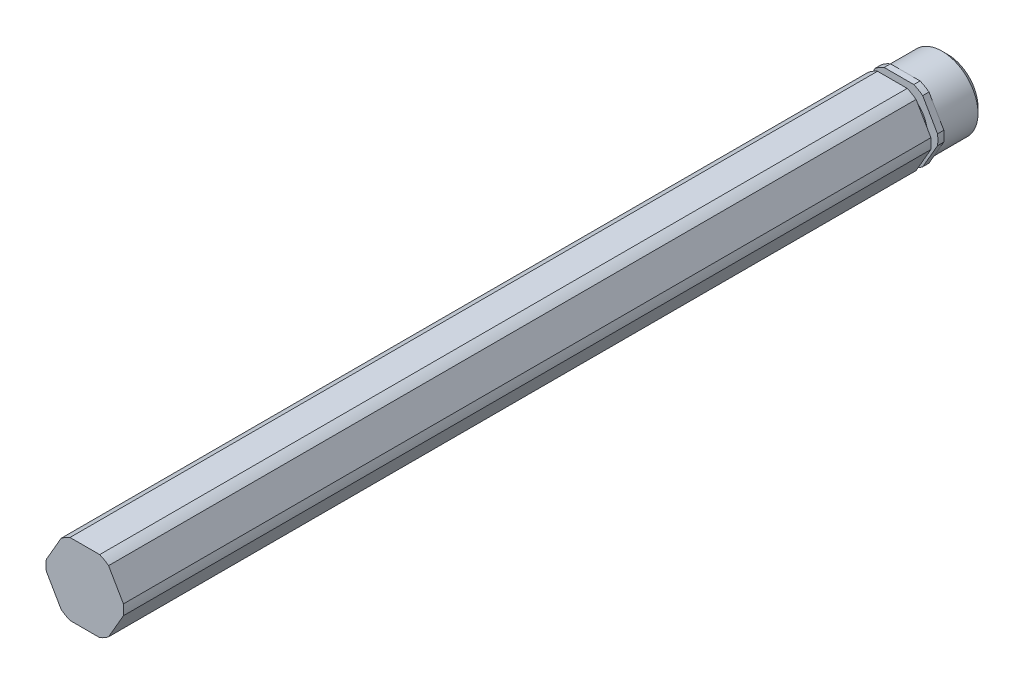
ISO-10303-21;
HEADER;
FILE_DESCRIPTION(('STEP AP214'),'2;1');
FILE_NAME('part.step','',(''),(''),'','','');
FILE_SCHEMA(('AUTOMOTIVE_DESIGN { 1 0 10303 214 1 1 1 1 }'));
ENDSEC;
DATA;
#1=APPLICATION_CONTEXT('core data for automotive mechanical design processes');
#2=APPLICATION_PROTOCOL_DEFINITION('international standard','automotive_design',2000,#1);
#3=PRODUCT_CONTEXT('',#1,'mechanical');
#4=PRODUCT('Part','Part','',(#3));
#5=PRODUCT_RELATED_PRODUCT_CATEGORY('part','',(#4));
#6=PRODUCT_DEFINITION_FORMATION('','',#4);
#7=PRODUCT_DEFINITION_CONTEXT('part definition',#1,'design');
#8=PRODUCT_DEFINITION('design','',#6,#7);
#9=PRODUCT_DEFINITION_SHAPE('','',#8);
#10=(LENGTH_UNIT() NAMED_UNIT(*) SI_UNIT(.MILLI.,.METRE.));
#11=(NAMED_UNIT(*) PLANE_ANGLE_UNIT() SI_UNIT($,.RADIAN.));
#12=(NAMED_UNIT(*) SI_UNIT($,.STERADIAN.) SOLID_ANGLE_UNIT());
#13=UNCERTAINTY_MEASURE_WITH_UNIT(LENGTH_MEASURE(1.E-05),#10,'distance_accuracy_value','');
#14=(GEOMETRIC_REPRESENTATION_CONTEXT(3) GLOBAL_UNCERTAINTY_ASSIGNED_CONTEXT((#13)) GLOBAL_UNIT_ASSIGNED_CONTEXT((#10,
#11,#12)) REPRESENTATION_CONTEXT('',''));
#15=CARTESIAN_POINT('',(0.,0.,0.));
#16=DIRECTION('',(0.,0.,1.));
#17=DIRECTION('',(1.,0.,0.));
#18=AXIS2_PLACEMENT_3D('',#15,#16,#17);
#19=CARTESIAN_POINT('',(7.33234841871,0.,-76.2));
#20=DIRECTION('',(0.,0.,1.));
#21=DIRECTION('',(1.,0.,0.));
#22=AXIS2_PLACEMENT_3D('',#19,#20,#21);
#23=PLANE('',#22);
#24=CARTESIAN_POINT('',(0.,0.,-76.2000000000285));
#25=DIRECTION('',(0.,0.,1.));
#26=DIRECTION('',(1.,0.,0.));
#27=AXIS2_PLACEMENT_3D('',#24,#25,#26);
#28=CIRCLE('',#27,5.35000000007813);
#29=CARTESIAN_POINT('',(5.35000000007813,0.,-76.2000000000285));
#30=VERTEX_POINT('',#29);
#31=EDGE_CURVE('E20',#30,#30,#28,.T.);
#32=ORIENTED_EDGE('',*,*,#31,.F.);
#33=EDGE_LOOP('',(#32));
#34=FACE_BOUND('',#33,.T.);
#35=ADVANCED_FACE('F17',(#34),#23,.F.);
#36=CARTESIAN_POINT('',(0.,0.,-75.200000000109));
#37=DIRECTION('',(0.,0.,1.));
#38=DIRECTION('',(1.,0.,0.));
#39=AXIS2_PLACEMENT_3D('',#36,#37,#38);
#40=CONICAL_SURFACE('',#39,6.34999999994079,0.785398163369027);
#41=ORIENTED_EDGE('',*,*,#31,.T.);
#42=EDGE_LOOP('',(#41));
#43=FACE_BOUND('',#42,.T.);
#44=CARTESIAN_POINT('',(0.,0.,-75.2));
#45=DIRECTION('',(0.,0.,-1.));
#46=DIRECTION('',(-1.,0.,0.));
#47=AXIS2_PLACEMENT_3D('',#44,#45,#46);
#48=CIRCLE('',#47,6.35);
#49=CARTESIAN_POINT('',(-6.35,0.,-75.2));
#50=VERTEX_POINT('',#49);
#51=EDGE_CURVE('E216',#50,#50,#48,.F.);
#52=ORIENTED_EDGE('',*,*,#51,.F.);
#53=EDGE_LOOP('',(#52));
#54=FACE_BOUND('',#53,.T.);
#55=ADVANCED_FACE('F614',(#43,#54),#40,.T.);
#56=CARTESIAN_POINT('',(0.,0.,-68.704));
#57=DIRECTION('',(0.,0.,-1.));
#58=DIRECTION('',(-1.,0.,0.));
#59=AXIS2_PLACEMENT_3D('',#56,#57,#58);
#60=CYLINDRICAL_SURFACE('',#59,6.35);
#61=CARTESIAN_POINT('',(0.,0.,-68.704));
#62=DIRECTION('',(0.,0.,-1.));
#63=DIRECTION('',(-1.,0.,0.));
#64=AXIS2_PLACEMENT_3D('',#61,#62,#63);
#65=CIRCLE('',#64,6.35);
#66=CARTESIAN_POINT('',(5.49926131387724,-3.17500000026387,-68.7039999996));
#67=VERTEX_POINT('',#66);
#68=CARTESIAN_POINT('',(5.499261314031,3.17500000000104,-68.704));
#69=VERTEX_POINT('',#68);
#70=EDGE_CURVE('E191',#67,#69,#65,.F.);
#71=ORIENTED_EDGE('',*,*,#70,.F.);
#72=CARTESIAN_POINT('',(0.,0.,-68.7039999992));
#73=DIRECTION('',(0.,0.,-1.));
#74=DIRECTION('',(-1.,0.,0.));
#75=AXIS2_PLACEMENT_3D('',#72,#73,#74);
#76=CIRCLE('',#75,6.35);
#77=CARTESIAN_POINT('',(-3.04382604190967E-10,-6.35,-68.7039999992));
#78=VERTEX_POINT('',#77);
#79=EDGE_CURVE('E202',#78,#67,#76,.F.);
#80=ORIENTED_EDGE('',*,*,#79,.F.);
#81=CARTESIAN_POINT('',(0.,0.,-68.7039999992));
#82=DIRECTION('',(0.,0.,-1.));
#83=DIRECTION('',(-1.,0.,0.));
#84=AXIS2_PLACEMENT_3D('',#81,#82,#83);
#85=CIRCLE('',#84,6.35);
#86=CARTESIAN_POINT('',(-5.4992613141845,-3.17499999973517,-68.7039999992));
#87=VERTEX_POINT('',#86);
#88=EDGE_CURVE('E321',#87,#78,#85,.F.);
#89=ORIENTED_EDGE('',*,*,#88,.F.);
#90=CARTESIAN_POINT('',(0.,0.,-68.7039999992));
#91=DIRECTION('',(0.,0.,-1.));
#92=DIRECTION('',(-1.,0.,0.));
#93=AXIS2_PLACEMENT_3D('',#90,#91,#92);
#94=CIRCLE('',#93,6.35);
#95=CARTESIAN_POINT('',(-5.49926131402949,3.17500000000017,-68.704));
#96=VERTEX_POINT('',#95);
#97=EDGE_CURVE('E323',#96,#87,#94,.F.);
#98=ORIENTED_EDGE('',*,*,#97,.F.);
#99=CARTESIAN_POINT('',(0.,0.,-68.704));
#100=DIRECTION('',(0.,0.,-1.));
#101=DIRECTION('',(-1.,0.,0.));
#102=AXIS2_PLACEMENT_3D('',#99,#100,#101);
#103=CIRCLE('',#102,6.35);
#104=CARTESIAN_POINT('',(0.,6.35,-68.704));
#105=VERTEX_POINT('',#104);
#106=EDGE_CURVE('E211',#105,#96,#103,.F.);
#107=ORIENTED_EDGE('',*,*,#106,.F.);
#108=CARTESIAN_POINT('',(0.,0.,-68.704));
#109=DIRECTION('',(0.,0.,-1.));
#110=DIRECTION('',(-1.,0.,0.));
#111=AXIS2_PLACEMENT_3D('',#108,#109,#110);
#112=CIRCLE('',#111,6.35);
#113=EDGE_CURVE('E207',#69,#105,#112,.F.);
#114=ORIENTED_EDGE('',*,*,#113,.F.);
#115=EDGE_LOOP('',(#71,#80,#89,#98,#107,#114));
#116=FACE_BOUND('',#115,.T.);
#117=ORIENTED_EDGE('',*,*,#51,.T.);
#118=EDGE_LOOP('',(#117));
#119=FACE_BOUND('',#118,.T.);
#120=ADVANCED_FACE('F208',(#116,#119),#60,.T.);
#121=CARTESIAN_POINT('',(0.,0.,-68.704));
#122=DIRECTION('',(0.,0.,-1.));
#123=DIRECTION('',(-1.,0.,0.));
#124=AXIS2_PLACEMENT_3D('',#121,#122,#123);
#125=PLANE('',#124);
#126=DIRECTION('',(0.50000000000019,-0.866025403784329,0.));
#127=VECTOR('',#126,1.);
#128=CARTESIAN_POINT('',(7.33234841871,0.,-68.7039999992));
#129=LINE('',#128,#127);
#130=CARTESIAN_POINT('',(4.18830746262131,5.44563867682668,-68.7039999992));
#131=VERTEX_POINT('',#130);
#132=EDGE_CURVE('E220',#131,#69,#129,.T.);
#133=ORIENTED_EDGE('',*,*,#132,.T.);
#134=ORIENTED_EDGE('',*,*,#113,.T.);
#135=DIRECTION('',(1.,0.,0.));
#136=VECTOR('',#135,1.);
#137=CARTESIAN_POINT('',(3.66617420935,6.35,-68.704));
#138=LINE('',#137,#136);
#139=CARTESIAN_POINT('',(2.62190770236911,6.35,-68.7039999996));
#140=VERTEX_POINT('',#139);
#141=EDGE_CURVE('E233',#105,#140,#138,.T.);
#142=ORIENTED_EDGE('',*,*,#141,.T.);
#143=CARTESIAN_POINT('',(0.,0.,-68.7039999992));
#144=DIRECTION('',(0.,0.,1.));
#145=DIRECTION('',(1.,0.,0.));
#146=AXIS2_PLACEMENT_3D('',#143,#144,#145);
#147=CIRCLE('',#146,6.87);
#148=EDGE_CURVE('E228',#131,#140,#147,.T.);
#149=ORIENTED_EDGE('',*,*,#148,.F.);
#150=EDGE_LOOP('',(#133,#134,#142,#149));
#151=FACE_BOUND('',#150,.T.);
#152=ADVANCED_FACE('F227',(#151),#125,.T.);
#153=CARTESIAN_POINT('',(0.,0.,-68.704));
#154=DIRECTION('',(0.,0.,-1.));
#155=DIRECTION('',(-1.,0.,0.));
#156=AXIS2_PLACEMENT_3D('',#153,#154,#155);
#157=PLANE('',#156);
#158=DIRECTION('',(1.,0.,0.));
#159=VECTOR('',#158,1.);
#160=CARTESIAN_POINT('',(3.66617420935,6.35,-68.7039999992));
#161=LINE('',#160,#159);
#162=CARTESIAN_POINT('',(-2.62190770265393,6.34999999990268,-68.7039999992));
#163=VERTEX_POINT('',#162);
#164=EDGE_CURVE('E318',#163,#105,#161,.T.);
#165=ORIENTED_EDGE('',*,*,#164,.T.);
#166=ORIENTED_EDGE('',*,*,#106,.T.);
#167=DIRECTION('',(0.50000000000019,0.866025403784329,0.));
#168=VECTOR('',#167,1.);
#169=CARTESIAN_POINT('',(-3.66617420935,6.35,-68.704));
#170=LINE('',#169,#168);
#171=CARTESIAN_POINT('',(-4.18830746284096,5.44563867663288,-68.7039999996));
#172=VERTEX_POINT('',#171);
#173=EDGE_CURVE('E331',#96,#172,#170,.T.);
#174=ORIENTED_EDGE('',*,*,#173,.T.);
#175=CARTESIAN_POINT('',(0.,0.,-68.7039999992));
#176=DIRECTION('',(0.,0.,1.));
#177=DIRECTION('',(1.,0.,0.));
#178=AXIS2_PLACEMENT_3D('',#175,#176,#177);
#179=CIRCLE('',#178,6.87);
#180=EDGE_CURVE('E314',#163,#172,#179,.T.);
#181=ORIENTED_EDGE('',*,*,#180,.F.);
#182=EDGE_LOOP('',(#165,#166,#174,#181));
#183=FACE_BOUND('',#182,.T.);
#184=ADVANCED_FACE('F329',(#183),#157,.T.);
#185=CARTESIAN_POINT('',(0.,0.,-68.704));
#186=DIRECTION('',(0.,0.,-1.));
#187=DIRECTION('',(-1.,0.,0.));
#188=AXIS2_PLACEMENT_3D('',#185,#186,#187);
#189=PLANE('',#188);
#190=DIRECTION('',(0.50000000000019,0.866025403784329,0.));
#191=VECTOR('',#190,1.);
#192=CARTESIAN_POINT('',(-3.66617420935,6.35,-68.7039999992));
#193=LINE('',#192,#191);
#194=CARTESIAN_POINT('',(-6.81021516527427,0.904361323071907,-68.7039999992));
#195=VERTEX_POINT('',#194);
#196=EDGE_CURVE('E316',#195,#96,#193,.T.);
#197=ORIENTED_EDGE('',*,*,#196,.T.);
#198=ORIENTED_EDGE('',*,*,#97,.T.);
#199=DIRECTION('',(-0.50000000000019,0.866025403784329,0.));
#200=VECTOR('',#199,1.);
#201=CARTESIAN_POINT('',(-7.33234841871,0.,-68.7039999992));
#202=LINE('',#201,#200);
#203=CARTESIAN_POINT('',(-6.81021516521675,-0.904361323371107,-68.7039999996));
#204=VERTEX_POINT('',#203);
#205=EDGE_CURVE('E349',#87,#204,#202,.T.);
#206=ORIENTED_EDGE('',*,*,#205,.T.);
#207=CARTESIAN_POINT('',(0.,0.,-68.704));
#208=DIRECTION('',(0.,0.,1.));
#209=DIRECTION('',(1.,0.,0.));
#210=AXIS2_PLACEMENT_3D('',#207,#208,#209);
#211=CIRCLE('',#210,6.87);
#212=EDGE_CURVE('E310',#195,#204,#211,.T.);
#213=ORIENTED_EDGE('',*,*,#212,.F.);
#214=EDGE_LOOP('',(#197,#198,#206,#213));
#215=FACE_BOUND('',#214,.T.);
#216=ADVANCED_FACE('F344',(#215),#189,.T.);
#217=CARTESIAN_POINT('',(0.,0.,-68.704));
#218=DIRECTION('',(0.,0.,-1.));
#219=DIRECTION('',(-1.,0.,0.));
#220=AXIS2_PLACEMENT_3D('',#217,#218,#219);
#221=PLANE('',#220);
#222=DIRECTION('',(-0.50000000000019,0.866025403784329,0.));
#223=VECTOR('',#222,1.);
#224=CARTESIAN_POINT('',(-7.33234841871,0.,-68.7039999992));
#225=LINE('',#224,#223);
#226=CARTESIAN_POINT('',(-4.18830746262132,-5.44563867682667,-68.7039999992));
#227=VERTEX_POINT('',#226);
#228=EDGE_CURVE('E312',#227,#87,#225,.T.);
#229=ORIENTED_EDGE('',*,*,#228,.T.);
#230=ORIENTED_EDGE('',*,*,#88,.T.);
#231=DIRECTION('',(1.,0.,0.));
#232=VECTOR('',#231,1.);
#233=CARTESIAN_POINT('',(-3.66617420935,-6.35,-68.7039999992));
#234=LINE('',#233,#232);
#235=CARTESIAN_POINT('',(-2.62190770236911,-6.35,-68.7039999992));
#236=VERTEX_POINT('',#235);
#237=EDGE_CURVE('E370',#78,#236,#234,.F.);
#238=ORIENTED_EDGE('',*,*,#237,.T.);
#239=CARTESIAN_POINT('',(0.,0.,-68.7039999992));
#240=DIRECTION('',(0.,0.,1.));
#241=DIRECTION('',(1.,0.,0.));
#242=AXIS2_PLACEMENT_3D('',#239,#240,#241);
#243=CIRCLE('',#242,6.87);
#244=EDGE_CURVE('E306',#227,#236,#243,.T.);
#245=ORIENTED_EDGE('',*,*,#244,.F.);
#246=EDGE_LOOP('',(#229,#230,#238,#245));
#247=FACE_BOUND('',#246,.T.);
#248=ADVANCED_FACE('F604',(#247),#221,.T.);
#249=CARTESIAN_POINT('',(0.,0.,-68.704));
#250=DIRECTION('',(0.,0.,-1.));
#251=DIRECTION('',(-1.,0.,0.));
#252=AXIS2_PLACEMENT_3D('',#249,#250,#251);
#253=PLANE('',#252);
#254=DIRECTION('',(-0.50000000000019,-0.866025403784329,0.));
#255=VECTOR('',#254,1.);
#256=CARTESIAN_POINT('',(3.66617420935,-6.35,-68.7040000007));
#257=LINE('',#256,#255);
#258=CARTESIAN_POINT('',(6.81021516524065,-0.904361323325035,-68.7040000007));
#259=VERTEX_POINT('',#258);
#260=EDGE_CURVE('E198',#259,#67,#257,.T.);
#261=ORIENTED_EDGE('',*,*,#260,.T.);
#262=ORIENTED_EDGE('',*,*,#70,.T.);
#263=DIRECTION('',(0.50000000000019,-0.866025403784329,0.));
#264=VECTOR('',#263,1.);
#265=CARTESIAN_POINT('',(7.33234841871,0.,-68.704));
#266=LINE('',#265,#264);
#267=CARTESIAN_POINT('',(6.81021516522741,0.904361323368613,-68.70400000035));
#268=VERTEX_POINT('',#267);
#269=EDGE_CURVE('E195',#69,#268,#266,.T.);
#270=ORIENTED_EDGE('',*,*,#269,.T.);
#271=CARTESIAN_POINT('',(0.,0.,-68.7040000007));
#272=DIRECTION('',(0.,0.,1.));
#273=DIRECTION('',(1.,0.,0.));
#274=AXIS2_PLACEMENT_3D('',#271,#272,#273);
#275=CIRCLE('',#274,6.87);
#276=EDGE_CURVE('E203',#268,#259,#275,.F.);
#277=ORIENTED_EDGE('',*,*,#276,.T.);
#278=EDGE_LOOP('',(#261,#262,#270,#277));
#279=FACE_BOUND('',#278,.T.);
#280=ADVANCED_FACE('F193',(#279),#253,.T.);
#281=CARTESIAN_POINT('',(0.,0.,-68.704));
#282=DIRECTION('',(0.,0.,-1.));
#283=DIRECTION('',(-1.,0.,0.));
#284=AXIS2_PLACEMENT_3D('',#281,#282,#283);
#285=PLANE('',#284);
#286=DIRECTION('',(1.,0.,0.));
#287=VECTOR('',#286,1.);
#288=CARTESIAN_POINT('',(-3.66617420935,-6.35,-68.7039999992));
#289=LINE('',#288,#287);
#290=CARTESIAN_POINT('',(2.62190770265393,-6.34999999990268,-68.7039999992));
#291=VERTEX_POINT('',#290);
#292=EDGE_CURVE('E308',#291,#78,#289,.F.);
#293=ORIENTED_EDGE('',*,*,#292,.T.);
#294=ORIENTED_EDGE('',*,*,#79,.T.);
#295=DIRECTION('',(-0.50000000000019,-0.866025403784329,0.));
#296=VECTOR('',#295,1.);
#297=CARTESIAN_POINT('',(3.66617420935,-6.35,-68.7039999992));
#298=LINE('',#297,#296);
#299=CARTESIAN_POINT('',(4.18830746284096,-5.44563867663288,-68.7039999992));
#300=VERTEX_POINT('',#299);
#301=EDGE_CURVE('E364',#67,#300,#298,.T.);
#302=ORIENTED_EDGE('',*,*,#301,.T.);
#303=CARTESIAN_POINT('',(0.,0.,-68.7039999992));
#304=DIRECTION('',(0.,0.,1.));
#305=DIRECTION('',(1.,0.,0.));
#306=AXIS2_PLACEMENT_3D('',#303,#304,#305);
#307=CIRCLE('',#306,6.87);
#308=EDGE_CURVE('E303',#291,#300,#307,.T.);
#309=ORIENTED_EDGE('',*,*,#308,.F.);
#310=EDGE_LOOP('',(#293,#294,#302,#309));
#311=FACE_BOUND('',#310,.T.);
#312=ADVANCED_FACE('F598',(#311),#285,.T.);
#313=CARTESIAN_POINT('',(7.33234841871,0.,76.2));
#314=DIRECTION('',(-0.866025403784329,-0.50000000000019,0.));
#315=DIRECTION('',(0.50000000000019,-0.866025403784329,0.));
#316=AXIS2_PLACEMENT_3D('',#313,#314,#315);
#317=PLANE('',#316);
#318=ORIENTED_EDGE('',*,*,#269,.F.);
#319=ORIENTED_EDGE('',*,*,#132,.F.);
#320=DIRECTION('',(0.,0.,1.));
#321=VECTOR('',#320,1.);
#322=CARTESIAN_POINT('',(4.18830746242026,5.44563867698131,-76.2));
#323=LINE('',#322,#321);
#324=CARTESIAN_POINT('',(4.18830746266712,5.44563867684879,-67.5924000003));
#325=VERTEX_POINT('',#324);
#326=EDGE_CURVE('E224',#325,#131,#323,.F.);
#327=ORIENTED_EDGE('',*,*,#326,.F.);
#328=DIRECTION('',(-0.499999999998982,0.866025403785026,0.));
#329=VECTOR('',#328,1.);
#330=CARTESIAN_POINT('',(6.81021516519,0.904361323409,-67.5924));
#331=LINE('',#330,#329);
#332=CARTESIAN_POINT('',(6.81021516522723,0.904361323362622,-67.5924000003));
#333=VERTEX_POINT('',#332);
#334=EDGE_CURVE('E298',#333,#325,#331,.T.);
#335=ORIENTED_EDGE('',*,*,#334,.F.);
#336=DIRECTION('',(0.,0.,1.));
#337=VECTOR('',#336,1.);
#338=CARTESIAN_POINT('',(6.81021516522882,0.904361323414155,-76.2));
#339=LINE('',#338,#337);
#340=EDGE_CURVE('E223',#268,#333,#339,.T.);
#341=ORIENTED_EDGE('',*,*,#340,.F.);
#342=EDGE_LOOP('',(#318,#319,#327,#335,#341));
#343=FACE_BOUND('',#342,.T.);
#344=ADVANCED_FACE('F218',(#343),#317,.F.);
#345=CARTESIAN_POINT('',(0.,0.,-76.2));
#346=DIRECTION('',(0.,0.,1.));
#347=DIRECTION('',(1.,0.,0.));
#348=AXIS2_PLACEMENT_3D('',#345,#346,#347);
#349=CYLINDRICAL_SURFACE('',#348,6.87);
#350=ORIENTED_EDGE('',*,*,#326,.T.);
#351=ORIENTED_EDGE('',*,*,#148,.T.);
#352=DIRECTION('',(0.,0.,-1.));
#353=VECTOR('',#352,1.);
#354=CARTESIAN_POINT('',(2.62190770232,6.35,76.2));
#355=LINE('',#354,#353);
#356=CARTESIAN_POINT('',(2.62190770236911,6.35,-67.5924000003));
#357=VERTEX_POINT('',#356);
#358=EDGE_CURVE('E351',#140,#357,#355,.F.);
#359=ORIENTED_EDGE('',*,*,#358,.T.);
#360=CARTESIAN_POINT('',(0.,0.,-67.5924000006));
#361=DIRECTION('',(0.,0.,1.));
#362=DIRECTION('',(1.,0.,0.));
#363=AXIS2_PLACEMENT_3D('',#360,#361,#362);
#364=CIRCLE('',#363,6.87);
#365=EDGE_CURVE('E296',#325,#357,#364,.T.);
#366=ORIENTED_EDGE('',*,*,#365,.F.);
#367=EDGE_LOOP('',(#350,#351,#359,#366));
#368=FACE_BOUND('',#367,.T.);
#369=ADVANCED_FACE('F592',(#368),#349,.T.);
#370=CARTESIAN_POINT('',(3.66617420935,6.35,76.2));
#371=DIRECTION('',(0.,-1.,0.));
#372=DIRECTION('',(0.,0.,-1.));
#373=AXIS2_PLACEMENT_3D('',#370,#371,#372);
#374=PLANE('',#373);
#375=ORIENTED_EDGE('',*,*,#141,.F.);
#376=ORIENTED_EDGE('',*,*,#164,.F.);
#377=DIRECTION('',(0.,0.,1.));
#378=VECTOR('',#377,1.);
#379=CARTESIAN_POINT('',(-2.62190770288963,6.34999999980536,-76.2));
#380=LINE('',#379,#378);
#381=CARTESIAN_POINT('',(-2.62190770265393,6.34999999995134,-67.5924000003));
#382=VERTEX_POINT('',#381);
#383=EDGE_CURVE('E317',#382,#163,#380,.F.);
#384=ORIENTED_EDGE('',*,*,#383,.F.);
#385=DIRECTION('',(1.,0.,0.));
#386=VECTOR('',#385,1.);
#387=CARTESIAN_POINT('',(0.,6.35,-67.5924));
#388=LINE('',#387,#386);
#389=EDGE_CURVE('E295',#357,#382,#388,.F.);
#390=ORIENTED_EDGE('',*,*,#389,.F.);
#391=ORIENTED_EDGE('',*,*,#358,.F.);
#392=EDGE_LOOP('',(#375,#376,#384,#390,#391));
#393=FACE_BOUND('',#392,.T.);
#394=ADVANCED_FACE('F589',(#393),#374,.F.);
#395=CARTESIAN_POINT('',(0.,0.,-76.2));
#396=DIRECTION('',(0.,0.,1.));
#397=DIRECTION('',(1.,0.,0.));
#398=AXIS2_PLACEMENT_3D('',#395,#396,#397);
#399=CYLINDRICAL_SURFACE('',#398,6.87);
#400=ORIENTED_EDGE('',*,*,#383,.T.);
#401=ORIENTED_EDGE('',*,*,#180,.T.);
#402=DIRECTION('',(0.,0.,1.));
#403=VECTOR('',#402,1.);
#404=CARTESIAN_POINT('',(-4.18830746286678,5.44563867658814,76.2));
#405=LINE('',#404,#403);
#406=CARTESIAN_POINT('',(-4.18830746284562,5.44563867663038,-67.5924000003));
#407=VERTEX_POINT('',#406);
#408=EDGE_CURVE('E341',#172,#407,#405,.T.);
#409=ORIENTED_EDGE('',*,*,#408,.T.);
#410=CARTESIAN_POINT('',(0.,0.,-67.5924000006));
#411=DIRECTION('',(0.,0.,1.));
#412=DIRECTION('',(1.,0.,0.));
#413=AXIS2_PLACEMENT_3D('',#410,#411,#412);
#414=CIRCLE('',#413,6.87);
#415=EDGE_CURVE('E293',#382,#407,#414,.T.);
#416=ORIENTED_EDGE('',*,*,#415,.F.);
#417=EDGE_LOOP('',(#400,#401,#409,#416));
#418=FACE_BOUND('',#417,.T.);
#419=ADVANCED_FACE('F389',(#418),#399,.T.);
#420=CARTESIAN_POINT('',(-3.66617420935,6.35,76.2));
#421=DIRECTION('',(0.866025403784329,-0.50000000000019,0.));
#422=DIRECTION('',(0.50000000000019,0.866025403784329,0.));
#423=AXIS2_PLACEMENT_3D('',#420,#421,#422);
#424=PLANE('',#423);
#425=ORIENTED_EDGE('',*,*,#173,.F.);
#426=ORIENTED_EDGE('',*,*,#196,.F.);
#427=DIRECTION('',(0.,0.,1.));
#428=VECTOR('',#427,1.);
#429=CARTESIAN_POINT('',(-6.81021516530748,0.904361322821778,-76.2));
#430=LINE('',#429,#428);
#431=CARTESIAN_POINT('',(-6.81021516527331,0.904361323079125,-67.5924));
#432=VERTEX_POINT('',#431);
#433=EDGE_CURVE('E313',#432,#195,#430,.F.);
#434=ORIENTED_EDGE('',*,*,#433,.F.);
#435=DIRECTION('',(-0.500000000000495,-0.866025403784153,0.));
#436=VECTOR('',#435,1.);
#437=CARTESIAN_POINT('',(-4.18830746287,5.44563867659,-67.5924));
#438=LINE('',#437,#436);
#439=EDGE_CURVE('E292',#407,#432,#438,.T.);
#440=ORIENTED_EDGE('',*,*,#439,.F.);
#441=ORIENTED_EDGE('',*,*,#408,.F.);
#442=EDGE_LOOP('',(#425,#426,#434,#440,#441));
#443=FACE_BOUND('',#442,.T.);
#444=ADVANCED_FACE('F336',(#443),#424,.F.);
#445=CARTESIAN_POINT('',(0.,0.,-76.2));
#446=DIRECTION('',(0.,0.,1.));
#447=DIRECTION('',(1.,0.,0.));
#448=AXIS2_PLACEMENT_3D('',#445,#446,#447);
#449=CYLINDRICAL_SURFACE('',#448,6.87);
#450=DIRECTION('',(0.,0.,1.));
#451=VECTOR('',#450,1.);
#452=CARTESIAN_POINT('',(-6.81021516519366,-0.904361323411111,76.2));
#453=LINE('',#452,#451);
#454=CARTESIAN_POINT('',(-6.81021516521657,-0.904361323365096,-67.5924000003));
#455=VERTEX_POINT('',#454);
#456=EDGE_CURVE('E376',#204,#455,#453,.T.);
#457=ORIENTED_EDGE('',*,*,#456,.T.);
#458=CARTESIAN_POINT('',(0.,0.,-67.5924000006));
#459=DIRECTION('',(0.,0.,1.));
#460=DIRECTION('',(1.,0.,0.));
#461=AXIS2_PLACEMENT_3D('',#458,#459,#460);
#462=CIRCLE('',#461,6.87);
#463=EDGE_CURVE('E290',#432,#455,#462,.T.);
#464=ORIENTED_EDGE('',*,*,#463,.F.);
#465=ORIENTED_EDGE('',*,*,#433,.T.);
#466=ORIENTED_EDGE('',*,*,#212,.T.);
#467=EDGE_LOOP('',(#457,#464,#465,#466));
#468=FACE_BOUND('',#467,.T.);
#469=ADVANCED_FACE('F581',(#468),#449,.T.);
#470=CARTESIAN_POINT('',(-7.33234841871,0.,76.2));
#471=DIRECTION('',(0.866025403784329,0.50000000000019,0.));
#472=DIRECTION('',(-0.50000000000019,0.866025403784329,0.));
#473=AXIS2_PLACEMENT_3D('',#470,#471,#472);
#474=PLANE('',#473);
#475=ORIENTED_EDGE('',*,*,#205,.F.);
#476=ORIENTED_EDGE('',*,*,#228,.F.);
#477=DIRECTION('',(0.,0.,1.));
#478=VECTOR('',#477,1.);
#479=CARTESIAN_POINT('',(-4.18830746242026,-5.44563867698131,-76.2));
#480=LINE('',#479,#478);
#481=CARTESIAN_POINT('',(-4.18830746266712,-5.44563867684879,-67.5924000003));
#482=VERTEX_POINT('',#481);
#483=EDGE_CURVE('E309',#482,#227,#480,.F.);
#484=ORIENTED_EDGE('',*,*,#483,.F.);
#485=DIRECTION('',(0.499999999998982,-0.866025403785026,0.));
#486=VECTOR('',#485,1.);
#487=CARTESIAN_POINT('',(-6.81021516519,-0.904361323409,-67.5924));
#488=LINE('',#487,#486);
#489=EDGE_CURVE('E289',#455,#482,#488,.T.);
#490=ORIENTED_EDGE('',*,*,#489,.F.);
#491=ORIENTED_EDGE('',*,*,#456,.F.);
#492=EDGE_LOOP('',(#475,#476,#484,#490,#491));
#493=FACE_BOUND('',#492,.T.);
#494=ADVANCED_FACE('F578',(#493),#474,.F.);
#495=CARTESIAN_POINT('',(0.,0.,-76.2));
#496=DIRECTION('',(0.,0.,1.));
#497=DIRECTION('',(1.,0.,0.));
#498=AXIS2_PLACEMENT_3D('',#495,#496,#497);
#499=CYLINDRICAL_SURFACE('',#498,6.87);
#500=ORIENTED_EDGE('',*,*,#483,.T.);
#501=ORIENTED_EDGE('',*,*,#244,.T.);
#502=DIRECTION('',(0.,0.,1.));
#503=VECTOR('',#502,1.);
#504=CARTESIAN_POINT('',(-2.62190770232,-6.35,76.2));
#505=LINE('',#504,#503);
#506=CARTESIAN_POINT('',(-2.62190770236911,-6.35,-67.5924000003));
#507=VERTEX_POINT('',#506);
#508=EDGE_CURVE('E372',#236,#507,#505,.T.);
#509=ORIENTED_EDGE('',*,*,#508,.T.);
#510=CARTESIAN_POINT('',(0.,0.,-67.5924000006));
#511=DIRECTION('',(0.,0.,1.));
#512=DIRECTION('',(1.,0.,0.));
#513=AXIS2_PLACEMENT_3D('',#510,#511,#512);
#514=CIRCLE('',#513,6.87);
#515=EDGE_CURVE('E287',#482,#507,#514,.T.);
#516=ORIENTED_EDGE('',*,*,#515,.F.);
#517=EDGE_LOOP('',(#500,#501,#509,#516));
#518=FACE_BOUND('',#517,.T.);
#519=ADVANCED_FACE('F410',(#518),#499,.T.);
#520=CARTESIAN_POINT('',(-3.66617420935,-6.35,76.2));
#521=DIRECTION('',(0.,1.,0.));
#522=DIRECTION('',(0.,0.,1.));
#523=AXIS2_PLACEMENT_3D('',#520,#521,#522);
#524=PLANE('',#523);
#525=ORIENTED_EDGE('',*,*,#237,.F.);
#526=ORIENTED_EDGE('',*,*,#292,.F.);
#527=DIRECTION('',(0.,0.,1.));
#528=VECTOR('',#527,1.);
#529=CARTESIAN_POINT('',(2.62190770288963,-6.34999999980536,-76.2));
#530=LINE('',#529,#528);
#531=CARTESIAN_POINT('',(2.62190770265393,-6.34999999995134,-67.5924000003));
#532=VERTEX_POINT('',#531);
#533=EDGE_CURVE('E305',#532,#291,#530,.F.);
#534=ORIENTED_EDGE('',*,*,#533,.F.);
#535=DIRECTION('',(1.,0.,0.));
#536=VECTOR('',#535,1.);
#537=CARTESIAN_POINT('',(0.,-6.35,-67.5924));
#538=LINE('',#537,#536);
#539=EDGE_CURVE('E286',#507,#532,#538,.T.);
#540=ORIENTED_EDGE('',*,*,#539,.F.);
#541=ORIENTED_EDGE('',*,*,#508,.F.);
#542=EDGE_LOOP('',(#525,#526,#534,#540,#541));
#543=FACE_BOUND('',#542,.T.);
#544=ADVANCED_FACE('F414',(#543),#524,.F.);
#545=CARTESIAN_POINT('',(0.,0.,-76.2));
#546=DIRECTION('',(0.,0.,1.));
#547=DIRECTION('',(1.,0.,0.));
#548=AXIS2_PLACEMENT_3D('',#545,#546,#547);
#549=CYLINDRICAL_SURFACE('',#548,6.87);
#550=ORIENTED_EDGE('',*,*,#533,.T.);
#551=ORIENTED_EDGE('',*,*,#308,.T.);
#552=DIRECTION('',(0.,0.,1.));
#553=VECTOR('',#552,1.);
#554=CARTESIAN_POINT('',(4.18830746286678,-5.44563867658814,76.2));
#555=LINE('',#554,#553);
#556=CARTESIAN_POINT('',(4.18830746284562,-5.44563867663038,-67.5924000003));
#557=VERTEX_POINT('',#556);
#558=EDGE_CURVE('E367',#300,#557,#555,.T.);
#559=ORIENTED_EDGE('',*,*,#558,.T.);
#560=CARTESIAN_POINT('',(0.,0.,-67.5924000006));
#561=DIRECTION('',(0.,0.,1.));
#562=DIRECTION('',(1.,0.,0.));
#563=AXIS2_PLACEMENT_3D('',#560,#561,#562);
#564=CIRCLE('',#563,6.87);
#565=EDGE_CURVE('E284',#532,#557,#564,.T.);
#566=ORIENTED_EDGE('',*,*,#565,.F.);
#567=EDGE_LOOP('',(#550,#551,#559,#566));
#568=FACE_BOUND('',#567,.T.);
#569=ADVANCED_FACE('F568',(#568),#549,.T.);
#570=CARTESIAN_POINT('',(3.66617420935,-6.35,76.2));
#571=DIRECTION('',(-0.866025403784329,0.50000000000019,0.));
#572=DIRECTION('',(-0.50000000000019,-0.866025403784329,0.));
#573=AXIS2_PLACEMENT_3D('',#570,#571,#572);
#574=PLANE('',#573);
#575=ORIENTED_EDGE('',*,*,#301,.F.);
#576=ORIENTED_EDGE('',*,*,#260,.F.);
#577=DIRECTION('',(0.,0.,1.));
#578=VECTOR('',#577,1.);
#579=CARTESIAN_POINT('',(6.81021516524026,-0.904361323328035,-76.2));
#580=LINE('',#579,#578);
#581=CARTESIAN_POINT('',(6.81021516524025,-0.904361323327696,-67.5924000001));
#582=VERTEX_POINT('',#581);
#583=EDGE_CURVE('E399',#582,#259,#580,.F.);
#584=ORIENTED_EDGE('',*,*,#583,.F.);
#585=DIRECTION('',(0.499999999999919,0.866025403784485,0.));
#586=VECTOR('',#585,1.);
#587=CARTESIAN_POINT('',(4.18830746287,-5.44563867659,-67.5924));
#588=LINE('',#587,#586);
#589=EDGE_CURVE('E283',#557,#582,#588,.T.);
#590=ORIENTED_EDGE('',*,*,#589,.F.);
#591=ORIENTED_EDGE('',*,*,#558,.F.);
#592=EDGE_LOOP('',(#575,#576,#584,#590,#591));
#593=FACE_BOUND('',#592,.T.);
#594=ADVANCED_FACE('F558',(#593),#574,.F.);
#595=CARTESIAN_POINT('',(0.,0.,-76.2));
#596=DIRECTION('',(0.,0.,1.));
#597=DIRECTION('',(1.,0.,0.));
#598=AXIS2_PLACEMENT_3D('',#595,#596,#597);
#599=CYLINDRICAL_SURFACE('',#598,6.87);
#600=ORIENTED_EDGE('',*,*,#340,.T.);
#601=CARTESIAN_POINT('',(0.,0.,-67.5924000006));
#602=DIRECTION('',(0.,0.,1.));
#603=DIRECTION('',(1.,0.,0.));
#604=AXIS2_PLACEMENT_3D('',#601,#602,#603);
#605=CIRCLE('',#604,6.87);
#606=EDGE_CURVE('E279',#582,#333,#605,.T.);
#607=ORIENTED_EDGE('',*,*,#606,.F.);
#608=ORIENTED_EDGE('',*,*,#583,.T.);
#609=ORIENTED_EDGE('',*,*,#276,.F.);
#610=EDGE_LOOP('',(#600,#607,#608,#609));
#611=FACE_BOUND('',#610,.T.);
#612=ADVANCED_FACE('F560',(#611),#599,.T.);
#613=CARTESIAN_POINT('',(0.,0.,-76.2));
#614=DIRECTION('',(0.,0.,1.));
#615=DIRECTION('',(1.,0.,0.));
#616=AXIS2_PLACEMENT_3D('',#613,#614,#615);
#617=CYLINDRICAL_SURFACE('',#616,6.87);
#618=CARTESIAN_POINT('',(0.,0.,76.2000000004));
#619=DIRECTION('',(0.,0.,1.));
#620=DIRECTION('',(1.,0.,0.));
#621=AXIS2_PLACEMENT_3D('',#618,#619,#620);
#622=CIRCLE('',#621,6.87);
#623=CARTESIAN_POINT('',(6.81021516524791,0.904361322869414,76.2));
#624=VERTEX_POINT('',#623);
#625=CARTESIAN_POINT('',(6.81021516523972,-0.904361323327447,76.2000000002));
#626=VERTEX_POINT('',#625);
#627=EDGE_CURVE('E299',#624,#626,#622,.F.);
#628=ORIENTED_EDGE('',*,*,#627,.T.);
#629=DIRECTION('',(0.,0.,1.));
#630=VECTOR('',#629,1.);
#631=CARTESIAN_POINT('',(6.81021516523821,-0.904361323326964,76.2));
#632=LINE('',#631,#630);
#633=CARTESIAN_POINT('',(6.81021516523972,-0.904361323327448,-66.42399999975));
#634=VERTEX_POINT('',#633);
#635=EDGE_CURVE('E429',#626,#634,#632,.F.);
#636=ORIENTED_EDGE('',*,*,#635,.T.);
#637=CARTESIAN_POINT('',(0.,0.,-66.4239999995));
#638=DIRECTION('',(0.,0.,1.));
#639=DIRECTION('',(1.,0.,0.));
#640=AXIS2_PLACEMENT_3D('',#637,#638,#639);
#641=CIRCLE('',#640,6.87);
#642=CARTESIAN_POINT('',(6.81021516502363,0.904361324558281,-66.4239999995));
#643=VERTEX_POINT('',#642);
#644=EDGE_CURVE('E301',#634,#643,#641,.T.);
#645=ORIENTED_EDGE('',*,*,#644,.T.);
#646=DIRECTION('',(0.,0.,1.));
#647=VECTOR('',#646,1.);
#648=CARTESIAN_POINT('',(6.81021516510153,0.904361323570646,76.2));
#649=LINE('',#648,#647);
#650=EDGE_CURVE('E426',#643,#624,#649,.T.);
#651=ORIENTED_EDGE('',*,*,#650,.T.);
#652=EDGE_LOOP('',(#628,#636,#645,#651));
#653=FACE_BOUND('',#652,.T.);
#654=ADVANCED_FACE('F511',(#653),#617,.T.);
#655=CARTESIAN_POINT('',(0.,9.67349289505,-67.5924));
#656=DIRECTION('',(0.,0.,1.));
#657=DIRECTION('',(1.,0.,0.));
#658=AXIS2_PLACEMENT_3D('',#655,#656,#657);
#659=PLANE('',#658);
#660=CARTESIAN_POINT('',(0.,0.,-67.5923999997));
#661=DIRECTION('',(0.,0.,1.));
#662=DIRECTION('',(1.,0.,0.));
#663=AXIS2_PLACEMENT_3D('',#660,#661,#662);
#664=CIRCLE('',#663,5.0292);
#665=CARTESIAN_POINT('',(5.0292,0.,-67.5923999997));
#666=VERTEX_POINT('',#665);
#667=EDGE_CURVE('E274',#666,#666,#664,.T.);
#668=ORIENTED_EDGE('',*,*,#667,.F.);
#669=EDGE_LOOP('',(#668));
#670=FACE_BOUND('',#669,.T.);
#671=ORIENTED_EDGE('',*,*,#589,.T.);
#672=ORIENTED_EDGE('',*,*,#606,.T.);
#673=ORIENTED_EDGE('',*,*,#334,.T.);
#674=ORIENTED_EDGE('',*,*,#365,.T.);
#675=ORIENTED_EDGE('',*,*,#389,.T.);
#676=ORIENTED_EDGE('',*,*,#415,.T.);
#677=ORIENTED_EDGE('',*,*,#439,.T.);
#678=ORIENTED_EDGE('',*,*,#463,.T.);
#679=ORIENTED_EDGE('',*,*,#489,.T.);
#680=ORIENTED_EDGE('',*,*,#515,.T.);
#681=ORIENTED_EDGE('',*,*,#539,.T.);
#682=ORIENTED_EDGE('',*,*,#565,.T.);
#683=EDGE_LOOP('',(#671,#672,#673,#674,#675,#676,#677,#678,#679,#680,#681,#682));
#684=FACE_BOUND('',#683,.T.);
#685=ADVANCED_FACE('F550',(#670,#684),#659,.T.);
#686=CARTESIAN_POINT('',(-3.66617420935,6.35,76.2));
#687=DIRECTION('',(0.866025403784329,-0.50000000000019,0.));
#688=DIRECTION('',(0.50000000000019,0.866025403784329,0.));
#689=AXIS2_PLACEMENT_3D('',#686,#687,#688);
#690=PLANE('',#689);
#691=DIRECTION('',(0.500000000217488,0.866025403658872,0.));
#692=VECTOR('',#691,1.);
#693=CARTESIAN_POINT('',(-6.81021516584,0.904361323997,-66.424));
#694=LINE('',#693,#692);
#695=CARTESIAN_POINT('',(-6.81021516514021,0.904361324081411,-66.424));
#696=VERTEX_POINT('',#695);
#697=CARTESIAN_POINT('',(-4.18830746215324,5.44563867718668,-66.424));
#698=VERTEX_POINT('',#697);
#699=EDGE_CURVE('E256',#696,#698,#694,.T.);
#700=ORIENTED_EDGE('',*,*,#699,.F.);
#701=DIRECTION('',(0.,0.,1.));
#702=VECTOR('',#701,1.);
#703=CARTESIAN_POINT('',(-6.81021516533469,0.904361322616906,-76.2));
#704=LINE('',#703,#702);
#705=CARTESIAN_POINT('',(-6.81021516544962,0.904361321751451,76.2));
#706=VERTEX_POINT('',#705);
#707=EDGE_CURVE('E277',#706,#696,#704,.F.);
#708=ORIENTED_EDGE('',*,*,#707,.F.);
#709=DIRECTION('',(-0.499999999796026,-0.866025403902203,0.));
#710=VECTOR('',#709,1.);
#711=CARTESIAN_POINT('',(-4.18830746291,5.44563867711,76.2));
#712=LINE('',#711,#710);
#713=CARTESIAN_POINT('',(-4.18830746294032,5.44563867658132,76.2));
#714=VERTEX_POINT('',#713);
#715=EDGE_CURVE('E268',#714,#706,#712,.T.);
#716=ORIENTED_EDGE('',*,*,#715,.F.);
#717=DIRECTION('',(0.,0.,1.));
#718=VECTOR('',#717,1.);
#719=CARTESIAN_POINT('',(-4.18830746244584,5.44563867696163,-76.2));
#720=LINE('',#719,#718);
#721=EDGE_CURVE('E282',#698,#714,#720,.T.);
#722=ORIENTED_EDGE('',*,*,#721,.F.);
#723=EDGE_LOOP('',(#700,#708,#716,#722));
#724=FACE_BOUND('',#723,.T.);
#725=ADVANCED_FACE('F488',(#724),#690,.F.);
#726=CARTESIAN_POINT('',(0.,0.,-76.2));
#727=DIRECTION('',(0.,0.,1.));
#728=DIRECTION('',(1.,0.,0.));
#729=AXIS2_PLACEMENT_3D('',#726,#727,#728);
#730=CYLINDRICAL_SURFACE('',#729,6.87);
#731=DIRECTION('',(0.,0.,-1.));
#732=VECTOR('',#731,1.);
#733=CARTESIAN_POINT('',(-2.62190770236,6.35,76.2));
#734=LINE('',#733,#732);
#735=CARTESIAN_POINT('',(-2.62190770283716,6.349999999815,76.2));
#736=VERTEX_POINT('',#735);
#737=CARTESIAN_POINT('',(-2.62190770330943,6.34999999962,-66.424));
#738=VERTEX_POINT('',#737);
#739=EDGE_CURVE('E420',#736,#738,#734,.T.);
#740=ORIENTED_EDGE('',*,*,#739,.T.);
#741=CARTESIAN_POINT('',(0.,0.,-66.424));
#742=DIRECTION('',(0.,0.,1.));
#743=DIRECTION('',(1.,0.,0.));
#744=AXIS2_PLACEMENT_3D('',#741,#742,#743);
#745=CIRCLE('',#744,6.87);
#746=EDGE_CURVE('E254',#698,#738,#745,.F.);
#747=ORIENTED_EDGE('',*,*,#746,.F.);
#748=ORIENTED_EDGE('',*,*,#721,.T.);
#749=CARTESIAN_POINT('',(0.,0.,76.2));
#750=DIRECTION('',(0.,0.,1.));
#751=DIRECTION('',(1.,0.,0.));
#752=AXIS2_PLACEMENT_3D('',#749,#750,#751);
#753=CIRCLE('',#752,6.87);
#754=EDGE_CURVE('E265',#736,#714,#753,.T.);
#755=ORIENTED_EDGE('',*,*,#754,.F.);
#756=EDGE_LOOP('',(#740,#747,#748,#755));
#757=FACE_BOUND('',#756,.T.);
#758=ADVANCED_FACE('F492',(#757),#730,.T.);
#759=CARTESIAN_POINT('',(3.66617420935,6.35,76.2));
#760=DIRECTION('',(0.,-1.,0.));
#761=DIRECTION('',(0.,0.,-1.));
#762=AXIS2_PLACEMENT_3D('',#759,#760,#761);
#763=PLANE('',#762);
#764=DIRECTION('',(-1.,0.,0.));
#765=VECTOR('',#764,1.);
#766=CARTESIAN_POINT('',(0.,6.34999999924,-66.424));
#767=LINE('',#766,#765);
#768=CARTESIAN_POINT('',(2.62190770317433,6.3499999996878,-66.424));
#769=VERTEX_POINT('',#768);
#770=EDGE_CURVE('E253',#738,#769,#767,.F.);
#771=ORIENTED_EDGE('',*,*,#770,.F.);
#772=ORIENTED_EDGE('',*,*,#739,.F.);
#773=DIRECTION('',(1.,0.,0.));
#774=VECTOR('',#773,1.);
#775=CARTESIAN_POINT('',(7.33234841871,6.34999999963,76.2));
#776=LINE('',#775,#774);
#777=CARTESIAN_POINT('',(2.62190770270206,6.3499999998828,76.2));
#778=VERTEX_POINT('',#777);
#779=EDGE_CURVE('E269',#778,#736,#776,.F.);
#780=ORIENTED_EDGE('',*,*,#779,.F.);
#781=DIRECTION('',(0.,0.,1.));
#782=VECTOR('',#781,1.);
#783=CARTESIAN_POINT('',(2.62190770208979,6.35000000013561,-76.2));
#784=LINE('',#783,#782);
#785=EDGE_CURVE('E423',#769,#778,#784,.T.);
#786=ORIENTED_EDGE('',*,*,#785,.F.);
#787=EDGE_LOOP('',(#771,#772,#780,#786));
#788=FACE_BOUND('',#787,.T.);
#789=ADVANCED_FACE('F498',(#788),#763,.F.);
#790=CARTESIAN_POINT('',(0.,0.,-76.2));
#791=DIRECTION('',(0.,0.,1.));
#792=DIRECTION('',(1.,0.,0.));
#793=AXIS2_PLACEMENT_3D('',#790,#791,#792);
#794=CYLINDRICAL_SURFACE('',#793,6.87);
#795=DIRECTION('',(0.,0.,1.));
#796=VECTOR('',#795,1.);
#797=CARTESIAN_POINT('',(4.18830746279713,5.44563867671575,76.2));
#798=LINE('',#797,#796);
#799=CARTESIAN_POINT('',(4.1883074636286,5.4456386760641,76.2));
#800=VERTEX_POINT('',#799);
#801=CARTESIAN_POINT('',(4.18830746232888,5.44563867706374,-66.424));
#802=VERTEX_POINT('',#801);
#803=EDGE_CURVE('E425',#800,#802,#798,.F.);
#804=ORIENTED_EDGE('',*,*,#803,.T.);
#805=CARTESIAN_POINT('',(0.,0.,-66.424));
#806=DIRECTION('',(0.,0.,1.));
#807=DIRECTION('',(1.,0.,0.));
#808=AXIS2_PLACEMENT_3D('',#805,#806,#807);
#809=CIRCLE('',#808,6.87);
#810=EDGE_CURVE('E250',#769,#802,#809,.F.);
#811=ORIENTED_EDGE('',*,*,#810,.F.);
#812=ORIENTED_EDGE('',*,*,#785,.T.);
#813=CARTESIAN_POINT('',(0.,0.,76.2));
#814=DIRECTION('',(0.,0.,1.));
#815=DIRECTION('',(1.,0.,0.));
#816=AXIS2_PLACEMENT_3D('',#813,#814,#815);
#817=CIRCLE('',#816,6.87);
#818=EDGE_CURVE('E270',#800,#778,#817,.T.);
#819=ORIENTED_EDGE('',*,*,#818,.F.);
#820=EDGE_LOOP('',(#804,#811,#812,#819));
#821=FACE_BOUND('',#820,.T.);
#822=ADVANCED_FACE('F501',(#821),#794,.T.);
#823=CARTESIAN_POINT('',(7.33234841871,0.,76.2));
#824=DIRECTION('',(-0.866025403784329,-0.50000000000019,0.));
#825=DIRECTION('',(0.50000000000019,-0.866025403784329,0.));
#826=AXIS2_PLACEMENT_3D('',#823,#824,#825);
#827=PLANE('',#826);
#828=DIRECTION('',(0.500000000217488,-0.866025403658872,0.));
#829=VECTOR('',#828,1.);
#830=CARTESIAN_POINT('',(4.18830746226,5.44563867672,-66.424));
#831=LINE('',#830,#829);
#832=EDGE_CURVE('E252',#802,#643,#831,.T.);
#833=ORIENTED_EDGE('',*,*,#832,.F.);
#834=ORIENTED_EDGE('',*,*,#803,.F.);
#835=DIRECTION('',(-0.499999999796026,0.866025403902203,0.));
#836=VECTOR('',#835,1.);
#837=CARTESIAN_POINT('',(6.81021516519,0.904361322522,76.2));
#838=LINE('',#837,#836);
#839=EDGE_CURVE('E273',#624,#800,#838,.T.);
#840=ORIENTED_EDGE('',*,*,#839,.F.);
#841=ORIENTED_EDGE('',*,*,#650,.F.);
#842=EDGE_LOOP('',(#833,#834,#840,#841));
#843=FACE_BOUND('',#842,.T.);
#844=ADVANCED_FACE('F506',(#843),#827,.F.);
#845=CARTESIAN_POINT('',(3.66617420935,-6.35,76.2));
#846=DIRECTION('',(-0.866025403784329,0.50000000000019,0.));
#847=DIRECTION('',(-0.50000000000019,-0.866025403784329,0.));
#848=AXIS2_PLACEMENT_3D('',#845,#846,#847);
#849=PLANE('',#848);
#850=DIRECTION('',(-0.500000000012847,-0.866025403777022,0.));
#851=VECTOR('',#850,1.);
#852=CARTESIAN_POINT('',(6.81021516524,-0.904361323328001,-66.424));
#853=LINE('',#852,#851);
#854=CARTESIAN_POINT('',(4.188307462367,-5.44563867702227,-66.424));
#855=VERTEX_POINT('',#854);
#856=EDGE_CURVE('E249',#634,#855,#853,.T.);
#857=ORIENTED_EDGE('',*,*,#856,.F.);
#858=ORIENTED_EDGE('',*,*,#635,.F.);
#859=DIRECTION('',(0.499999999869734,0.866025403859648,0.));
#860=VECTOR('',#859,1.);
#861=CARTESIAN_POINT('',(4.18830746348,-5.44563867711,76.2));
#862=LINE('',#861,#860);
#863=CARTESIAN_POINT('',(4.1883074632669,-5.44563867633015,76.2));
#864=VERTEX_POINT('',#863);
#865=EDGE_CURVE('E263',#864,#626,#862,.T.);
#866=ORIENTED_EDGE('',*,*,#865,.F.);
#867=DIRECTION('',(0.,0.,1.));
#868=VECTOR('',#867,1.);
#869=CARTESIAN_POINT('',(4.18830746207374,-5.44563867724783,-76.2));
#870=LINE('',#869,#868);
#871=EDGE_CURVE('E434',#855,#864,#870,.T.);
#872=ORIENTED_EDGE('',*,*,#871,.F.);
#873=EDGE_LOOP('',(#857,#858,#866,#872));
#874=FACE_BOUND('',#873,.T.);
#875=ADVANCED_FACE('F514',(#874),#849,.F.);
#876=CARTESIAN_POINT('',(0.,0.,-76.2));
#877=DIRECTION('',(0.,0.,1.));
#878=DIRECTION('',(1.,0.,0.));
#879=AXIS2_PLACEMENT_3D('',#876,#877,#878);
#880=CYLINDRICAL_SURFACE('',#879,6.87);
#881=ORIENTED_EDGE('',*,*,#871,.T.);
#882=CARTESIAN_POINT('',(0.,0.,76.2));
#883=DIRECTION('',(0.,0.,1.));
#884=DIRECTION('',(1.,0.,0.));
#885=AXIS2_PLACEMENT_3D('',#882,#883,#884);
#886=CIRCLE('',#885,6.87);
#887=CARTESIAN_POINT('',(2.62190770312216,-6.349999999815,76.2));
#888=VERTEX_POINT('',#887);
#889=EDGE_CURVE('E260',#888,#864,#886,.T.);
#890=ORIENTED_EDGE('',*,*,#889,.F.);
#891=DIRECTION('',(0.,0.,1.));
#892=VECTOR('',#891,1.);
#893=CARTESIAN_POINT('',(2.62190770293,-6.35,76.2));
#894=LINE('',#893,#892);
#895=CARTESIAN_POINT('',(2.621907702662,-6.350000000005,-66.424));
#896=VERTEX_POINT('',#895);
#897=EDGE_CURVE('E278',#888,#896,#894,.F.);
#898=ORIENTED_EDGE('',*,*,#897,.T.);
#899=CARTESIAN_POINT('',(0.,0.,-66.424));
#900=DIRECTION('',(0.,0.,1.));
#901=DIRECTION('',(1.,0.,0.));
#902=AXIS2_PLACEMENT_3D('',#899,#900,#901);
#903=CIRCLE('',#902,6.87);
#904=EDGE_CURVE('E247',#855,#896,#903,.F.);
#905=ORIENTED_EDGE('',*,*,#904,.F.);
#906=EDGE_LOOP('',(#881,#890,#898,#905));
#907=FACE_BOUND('',#906,.T.);
#908=ADVANCED_FACE('F517',(#907),#880,.T.);
#909=CARTESIAN_POINT('',(-3.66617420935,-6.35,76.2));
#910=DIRECTION('',(0.,1.,0.));
#911=DIRECTION('',(0.,0.,1.));
#912=AXIS2_PLACEMENT_3D('',#909,#910,#911);
#913=PLANE('',#912);
#914=DIRECTION('',(-1.,0.,0.));
#915=VECTOR('',#914,1.);
#916=CARTESIAN_POINT('',(0.,-6.35000000001,-66.424));
#917=LINE('',#916,#915);
#918=CARTESIAN_POINT('',(-2.62190770210609,-6.35000000012888,-66.424));
#919=VERTEX_POINT('',#918);
#920=EDGE_CURVE('E246',#896,#919,#917,.T.);
#921=ORIENTED_EDGE('',*,*,#920,.F.);
#922=ORIENTED_EDGE('',*,*,#897,.F.);
#923=DIRECTION('',(1.,0.,0.));
#924=VECTOR('',#923,1.);
#925=CARTESIAN_POINT('',(7.33234841871,-6.34999999963,76.2));
#926=LINE('',#925,#924);
#927=CARTESIAN_POINT('',(-2.62190770256625,-6.34999999993888,76.2));
#928=VERTEX_POINT('',#927);
#929=EDGE_CURVE('E264',#928,#888,#926,.T.);
#930=ORIENTED_EDGE('',*,*,#929,.F.);
#931=DIRECTION('',(0.,0.,1.));
#932=VECTOR('',#931,1.);
#933=CARTESIAN_POINT('',(-2.62190770181817,-6.35000000024776,-76.2));
#934=LINE('',#933,#932);
#935=EDGE_CURVE('E259',#919,#928,#934,.T.);
#936=ORIENTED_EDGE('',*,*,#935,.F.);
#937=EDGE_LOOP('',(#921,#922,#930,#936));
#938=FACE_BOUND('',#937,.T.);
#939=ADVANCED_FACE('F471',(#938),#913,.F.);
#940=CARTESIAN_POINT('',(0.,0.,-56.8163271418));
#941=DIRECTION('',(0.,0.,1.));
#942=DIRECTION('',(1.,0.,0.));
#943=AXIS2_PLACEMENT_3D('',#940,#941,#942);
#944=CYLINDRICAL_SURFACE('',#943,5.0292);
#945=ORIENTED_EDGE('',*,*,#667,.T.);
#946=EDGE_LOOP('',(#945));
#947=FACE_BOUND('',#946,.T.);
#948=CARTESIAN_POINT('',(0.,0.,-66.4240000008));
#949=DIRECTION('',(0.,0.,1.));
#950=DIRECTION('',(1.,0.,0.));
#951=AXIS2_PLACEMENT_3D('',#948,#949,#950);
#952=CIRCLE('',#951,5.0292);
#953=CARTESIAN_POINT('',(5.0292,0.,-66.4240000008));
#954=VERTEX_POINT('',#953);
#955=EDGE_CURVE('E241',#954,#954,#952,.T.);
#956=ORIENTED_EDGE('',*,*,#955,.F.);
#957=EDGE_LOOP('',(#956));
#958=FACE_BOUND('',#957,.T.);
#959=ADVANCED_FACE('F525',(#947,#958),#944,.T.);
#960=CARTESIAN_POINT('',(7.33234841871,0.,76.2));
#961=DIRECTION('',(0.,0.,1.));
#962=DIRECTION('',(1.,0.,0.));
#963=AXIS2_PLACEMENT_3D('',#960,#961,#962);
#964=PLANE('',#963);
#965=ORIENTED_EDGE('',*,*,#627,.F.);
#966=ORIENTED_EDGE('',*,*,#839,.T.);
#967=ORIENTED_EDGE('',*,*,#818,.T.);
#968=ORIENTED_EDGE('',*,*,#779,.T.);
#969=ORIENTED_EDGE('',*,*,#754,.T.);
#970=ORIENTED_EDGE('',*,*,#715,.T.);
#971=CARTESIAN_POINT('',(0.,0.,76.2));
#972=DIRECTION('',(0.,0.,1.));
#973=DIRECTION('',(1.,0.,0.));
#974=AXIS2_PLACEMENT_3D('',#971,#972,#973);
#975=CIRCLE('',#974,6.87);
#976=CARTESIAN_POINT('',(-6.81021516540604,-0.904361323043253,76.2));
#977=VERTEX_POINT('',#976);
#978=EDGE_CURVE('E237',#977,#706,#975,.F.);
#979=ORIENTED_EDGE('',*,*,#978,.F.);
#980=DIRECTION('',(-0.50000000000019,0.866025403784329,0.));
#981=VECTOR('',#980,1.);
#982=CARTESIAN_POINT('',(-7.33234841871,0.,76.2));
#983=LINE('',#982,#981);
#984=CARTESIAN_POINT('',(-4.18830746273851,-5.4456386768173,76.2));
#985=VERTEX_POINT('',#984);
#986=EDGE_CURVE('E239',#977,#985,#983,.F.);
#987=ORIENTED_EDGE('',*,*,#986,.T.);
#988=CARTESIAN_POINT('',(0.,0.,76.2));
#989=DIRECTION('',(0.,0.,1.));
#990=DIRECTION('',(1.,0.,0.));
#991=AXIS2_PLACEMENT_3D('',#988,#989,#990);
#992=CIRCLE('',#991,6.87);
#993=EDGE_CURVE('E257',#928,#985,#992,.F.);
#994=ORIENTED_EDGE('',*,*,#993,.F.);
#995=ORIENTED_EDGE('',*,*,#929,.T.);
#996=ORIENTED_EDGE('',*,*,#889,.T.);
#997=ORIENTED_EDGE('',*,*,#865,.T.);
#998=EDGE_LOOP('',(#965,#966,#967,#968,#969,#970,#979,#987,#994,#995,#996,#997));
#999=FACE_BOUND('',#998,.T.);
#1000=ADVANCED_FACE('F481',(#999),#964,.T.);
#1001=CARTESIAN_POINT('',(0.,0.,-76.2));
#1002=DIRECTION('',(0.,0.,1.));
#1003=DIRECTION('',(1.,0.,0.));
#1004=AXIS2_PLACEMENT_3D('',#1001,#1002,#1003);
#1005=CYLINDRICAL_SURFACE('',#1004,6.87);
#1006=DIRECTION('',(0.,0.,1.));
#1007=VECTOR('',#1006,1.);
#1008=CARTESIAN_POINT('',(-4.18830746265464,-5.44563867696257,76.2));
#1009=LINE('',#1008,#1007);
#1010=CARTESIAN_POINT('',(-4.18830746273851,-5.4456386768173,-66.424));
#1011=VERTEX_POINT('',#1010);
#1012=EDGE_CURVE('E451',#985,#1011,#1009,.F.);
#1013=ORIENTED_EDGE('',*,*,#1012,.T.);
#1014=CARTESIAN_POINT('',(0.,0.,-66.424));
#1015=DIRECTION('',(0.,0.,1.));
#1016=DIRECTION('',(1.,0.,0.));
#1017=AXIS2_PLACEMENT_3D('',#1014,#1015,#1016);
#1018=CIRCLE('',#1017,6.87);
#1019=EDGE_CURVE('E244',#919,#1011,#1018,.F.);
#1020=ORIENTED_EDGE('',*,*,#1019,.F.);
#1021=ORIENTED_EDGE('',*,*,#935,.T.);
#1022=ORIENTED_EDGE('',*,*,#993,.T.);
#1023=EDGE_LOOP('',(#1013,#1020,#1021,#1022));
#1024=FACE_BOUND('',#1023,.T.);
#1025=ADVANCED_FACE('F474',(#1024),#1005,.T.);
#1026=CARTESIAN_POINT('',(0.,9.67349289505,-66.424));
#1027=DIRECTION('',(0.,0.,-1.));
#1028=DIRECTION('',(-1.,0.,0.));
#1029=AXIS2_PLACEMENT_3D('',#1026,#1027,#1028);
#1030=PLANE('',#1029);
#1031=ORIENTED_EDGE('',*,*,#955,.T.);
#1032=EDGE_LOOP('',(#1031));
#1033=FACE_BOUND('',#1032,.T.);
#1034=CARTESIAN_POINT('',(0.,0.,-66.424));
#1035=DIRECTION('',(0.,0.,1.));
#1036=DIRECTION('',(1.,0.,0.));
#1037=AXIS2_PLACEMENT_3D('',#1034,#1035,#1036);
#1038=CIRCLE('',#1037,6.87);
#1039=CARTESIAN_POINT('',(-6.81021516540604,-0.904361323043253,-66.424));
#1040=VERTEX_POINT('',#1039);
#1041=EDGE_CURVE('E34',#696,#1040,#1038,.T.);
#1042=ORIENTED_EDGE('',*,*,#1041,.F.);
#1043=ORIENTED_EDGE('',*,*,#699,.T.);
#1044=ORIENTED_EDGE('',*,*,#746,.T.);
#1045=ORIENTED_EDGE('',*,*,#770,.T.);
#1046=ORIENTED_EDGE('',*,*,#810,.T.);
#1047=ORIENTED_EDGE('',*,*,#832,.T.);
#1048=ORIENTED_EDGE('',*,*,#644,.F.);
#1049=ORIENTED_EDGE('',*,*,#856,.T.);
#1050=ORIENTED_EDGE('',*,*,#904,.T.);
#1051=ORIENTED_EDGE('',*,*,#920,.T.);
#1052=ORIENTED_EDGE('',*,*,#1019,.T.);
#1053=DIRECTION('',(-0.50000000000019,0.866025403784329,0.));
#1054=VECTOR('',#1053,1.);
#1055=CARTESIAN_POINT('',(-7.33234841871,0.,-66.424));
#1056=LINE('',#1055,#1054);
#1057=EDGE_CURVE('E26',#1011,#1040,#1056,.T.);
#1058=ORIENTED_EDGE('',*,*,#1057,.T.);
#1059=EDGE_LOOP('',(#1042,#1043,#1044,#1045,#1046,#1047,#1048,#1049,#1050,#1051,#1052,#1058));
#1060=FACE_BOUND('',#1059,.T.);
#1061=ADVANCED_FACE('F465',(#1033,#1060),#1030,.T.);
#1062=CARTESIAN_POINT('',(0.,0.,-76.2));
#1063=DIRECTION('',(0.,0.,1.));
#1064=DIRECTION('',(1.,0.,0.));
#1065=AXIS2_PLACEMENT_3D('',#1062,#1063,#1064);
#1066=CYLINDRICAL_SURFACE('',#1065,6.87);
#1067=DIRECTION('',(0.,0.,1.));
#1068=VECTOR('',#1067,1.);
#1069=CARTESIAN_POINT('',(-6.81021516557223,-0.904361322755402,76.2));
#1070=LINE('',#1069,#1068);
#1071=EDGE_CURVE('E11',#1040,#977,#1070,.T.);
#1072=ORIENTED_EDGE('',*,*,#1071,.T.);
#1073=ORIENTED_EDGE('',*,*,#978,.T.);
#1074=ORIENTED_EDGE('',*,*,#707,.T.);
#1075=ORIENTED_EDGE('',*,*,#1041,.T.);
#1076=EDGE_LOOP('',(#1072,#1073,#1074,#1075));
#1077=FACE_BOUND('',#1076,.T.);
#1078=ADVANCED_FACE('F484',(#1077),#1066,.T.);
#1079=CARTESIAN_POINT('',(-7.33234841871,0.,76.2));
#1080=DIRECTION('',(0.866025403784329,0.50000000000019,0.));
#1081=DIRECTION('',(-0.50000000000019,0.866025403784329,0.));
#1082=AXIS2_PLACEMENT_3D('',#1079,#1080,#1081);
#1083=PLANE('',#1082);
#1084=ORIENTED_EDGE('',*,*,#1057,.F.);
#1085=ORIENTED_EDGE('',*,*,#1012,.F.);
#1086=ORIENTED_EDGE('',*,*,#986,.F.);
#1087=ORIENTED_EDGE('',*,*,#1071,.F.);
#1088=EDGE_LOOP('',(#1084,#1085,#1086,#1087));
#1089=FACE_BOUND('',#1088,.T.);
#1090=ADVANCED_FACE('F478',(#1089),#1083,.F.);
#1091=CLOSED_SHELL('',(#35,#55,#120,#152,#184,#216,#248,#280,#312,#344,#369,#394,#419,#444,#469,
#494,#519,#544,#569,#594,#612,#654,#685,#725,#758,#789,#822,#844,#875,#908,#939,#959,#1000,
#1025,#1061,#1078,#1090));
#1092=MANIFOLD_SOLID_BREP('B1',#1091);
#1093=ADVANCED_BREP_SHAPE_REPRESENTATION('',(#18,#1092),#14);
#1094=SHAPE_DEFINITION_REPRESENTATION(#9,#1093);
ENDSEC;
END-ISO-10303-21;
